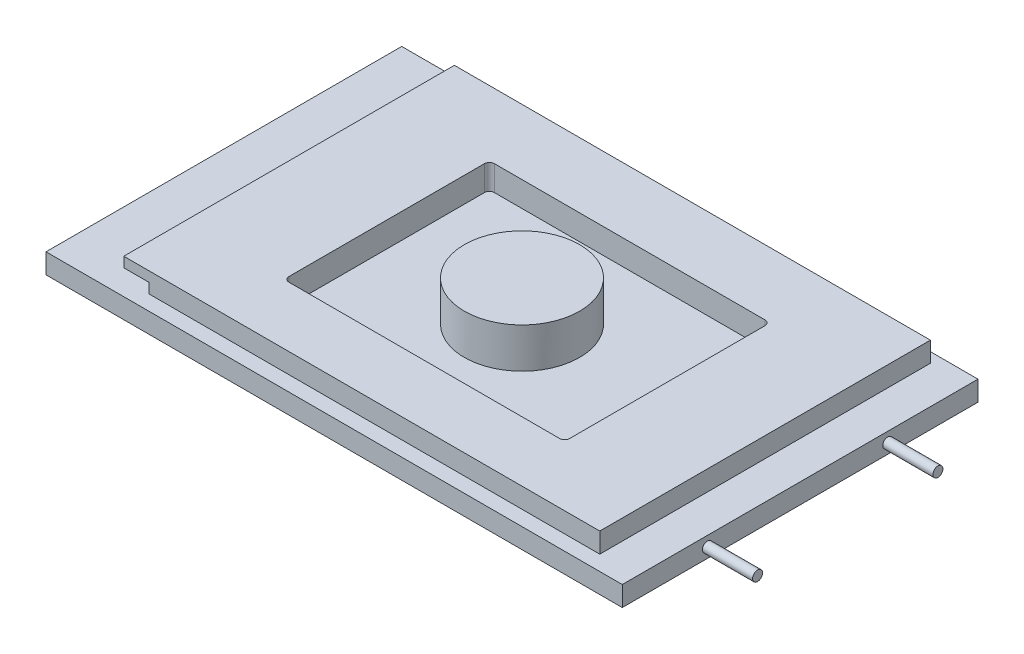
ISO-10303-21;
HEADER;
FILE_DESCRIPTION(('STEP AP214'),'2;1');
FILE_NAME('part.step','',(''),(''),'','','');
FILE_SCHEMA(('AUTOMOTIVE_DESIGN { 1 0 10303 214 1 1 1 1 }'));
ENDSEC;
DATA;
#1=APPLICATION_CONTEXT('core data for automotive mechanical design processes');
#2=APPLICATION_PROTOCOL_DEFINITION('international standard','automotive_design',2000,#1);
#3=PRODUCT_CONTEXT('',#1,'mechanical');
#4=PRODUCT('Part','Part','',(#3));
#5=PRODUCT_RELATED_PRODUCT_CATEGORY('part','',(#4));
#6=PRODUCT_DEFINITION_FORMATION('','',#4);
#7=PRODUCT_DEFINITION_CONTEXT('part definition',#1,'design');
#8=PRODUCT_DEFINITION('design','',#6,#7);
#9=PRODUCT_DEFINITION_SHAPE('','',#8);
#10=(LENGTH_UNIT() NAMED_UNIT(*) SI_UNIT(.MILLI.,.METRE.));
#11=(NAMED_UNIT(*) PLANE_ANGLE_UNIT() SI_UNIT($,.RADIAN.));
#12=(NAMED_UNIT(*) SI_UNIT($,.STERADIAN.) SOLID_ANGLE_UNIT());
#13=UNCERTAINTY_MEASURE_WITH_UNIT(LENGTH_MEASURE(1.E-05),#10,'distance_accuracy_value','');
#14=(GEOMETRIC_REPRESENTATION_CONTEXT(3) GLOBAL_UNCERTAINTY_ASSIGNED_CONTEXT((#13)) GLOBAL_UNIT_ASSIGNED_CONTEXT((#10,
#11,#12)) REPRESENTATION_CONTEXT('',''));
#15=CARTESIAN_POINT('',(0.,0.,0.));
#16=DIRECTION('',(0.,0.,1.));
#17=DIRECTION('',(1.,0.,0.));
#18=AXIS2_PLACEMENT_3D('',#15,#16,#17);
#19=CARTESIAN_POINT('',(0.,3.9878,0.));
#20=DIRECTION('',(0.,-1.,0.));
#21=DIRECTION('',(0.,0.,-1.));
#22=AXIS2_PLACEMENT_3D('',#19,#20,#21);
#23=PLANE('',#22);
#24=DIRECTION('',(0.,0.,1.));
#25=VECTOR('',#24,1.);
#26=CARTESIAN_POINT('',(0.,3.9878,0.));
#27=LINE('',#26,#25);
#28=CARTESIAN_POINT('',(0.,3.9878,-70.993));
#29=VERTEX_POINT('',#28);
#30=CARTESIAN_POINT('',(0.,3.9878,0.));
#31=VERTEX_POINT('',#30);
#32=EDGE_CURVE('E295',#29,#31,#27,.T.);
#33=ORIENTED_EDGE('',*,*,#32,.T.);
#34=DIRECTION('',(1.,0.,0.));
#35=VECTOR('',#34,1.);
#36=CARTESIAN_POINT('',(0.,3.9878,0.));
#37=LINE('',#36,#35);
#38=CARTESIAN_POINT('',(115.0112,3.9878,0.));
#39=VERTEX_POINT('',#38);
#40=EDGE_CURVE('E298',#31,#39,#37,.T.);
#41=ORIENTED_EDGE('',*,*,#40,.T.);
#42=DIRECTION('',(0.,0.,-1.));
#43=VECTOR('',#42,1.);
#44=CARTESIAN_POINT('',(115.0112,3.9878,0.));
#45=LINE('',#44,#43);
#46=CARTESIAN_POINT('',(115.0112,3.9878,-70.993));
#47=VERTEX_POINT('',#46);
#48=EDGE_CURVE('E301',#39,#47,#45,.T.);
#49=ORIENTED_EDGE('',*,*,#48,.T.);
#50=DIRECTION('',(-1.,0.,0.));
#51=VECTOR('',#50,1.);
#52=CARTESIAN_POINT('',(0.,3.9878,-70.993));
#53=LINE('',#52,#51);
#54=EDGE_CURVE('E303',#47,#29,#53,.T.);
#55=ORIENTED_EDGE('',*,*,#54,.T.);
#56=EDGE_LOOP('',(#33,#41,#49,#55));
#57=FACE_BOUND('',#56,.T.);
#58=DIRECTION('',(0.,0.,1.));
#59=VECTOR('',#58,1.);
#60=CARTESIAN_POINT('',(17.526,3.9878,-68.9864));
#61=LINE('',#60,#59);
#62=CARTESIAN_POINT('',(17.526,3.9878,-68.9864));
#63=VERTEX_POINT('',#62);
#64=CARTESIAN_POINT('',(17.526,3.9878,-2.99720000000001));
#65=VERTEX_POINT('',#64);
#66=EDGE_CURVE('E70',#63,#65,#61,.T.);
#67=ORIENTED_EDGE('',*,*,#66,.F.);
#68=DIRECTION('',(-1.,0.,0.));
#69=VECTOR('',#68,1.);
#70=CARTESIAN_POINT('',(17.526,3.9878,-68.9864));
#71=LINE('',#70,#69);
#72=CARTESIAN_POINT('',(107.5182,3.9878,-68.9864));
#73=VERTEX_POINT('',#72);
#74=EDGE_CURVE('E274',#73,#63,#71,.T.);
#75=ORIENTED_EDGE('',*,*,#74,.F.);
#76=DIRECTION('',(0.,0.,-1.));
#77=VECTOR('',#76,1.);
#78=CARTESIAN_POINT('',(107.5182,3.9878,-68.9864));
#79=LINE('',#78,#77);
#80=CARTESIAN_POINT('',(107.5182,3.9878,-2.9972));
#81=VERTEX_POINT('',#80);
#82=EDGE_CURVE('E279',#81,#73,#79,.T.);
#83=ORIENTED_EDGE('',*,*,#82,.F.);
#84=DIRECTION('',(1.,0.,0.));
#85=VECTOR('',#84,1.);
#86=CARTESIAN_POINT('',(17.526,3.9878,-2.99720000000001));
#87=LINE('',#86,#85);
#88=EDGE_CURVE('E276',#65,#81,#87,.T.);
#89=ORIENTED_EDGE('',*,*,#88,.F.);
#90=EDGE_LOOP('',(#67,#75,#83,#89));
#91=FACE_BOUND('',#90,.T.);
#92=ADVANCED_FACE('F47',(#57,#91),#23,.F.);
#93=CARTESIAN_POINT('',(0.,3.9878,0.));
#94=DIRECTION('',(1.,0.,0.));
#95=DIRECTION('',(0.,0.,-1.));
#96=AXIS2_PLACEMENT_3D('',#93,#94,#95);
#97=PLANE('',#96);
#98=DIRECTION('',(0.,0.,1.));
#99=VECTOR('',#98,1.);
#100=CARTESIAN_POINT('',(0.,0.,0.));
#101=LINE('',#100,#99);
#102=CARTESIAN_POINT('',(0.,0.,-70.993));
#103=VERTEX_POINT('',#102);
#104=CARTESIAN_POINT('',(0.,0.,0.));
#105=VERTEX_POINT('',#104);
#106=EDGE_CURVE('E294',#103,#105,#101,.T.);
#107=ORIENTED_EDGE('',*,*,#106,.T.);
#108=DIRECTION('',(0.,-1.,0.));
#109=VECTOR('',#108,1.);
#110=CARTESIAN_POINT('',(0.,3.9878,0.));
#111=LINE('',#110,#109);
#112=EDGE_CURVE('E321',#31,#105,#111,.T.);
#113=ORIENTED_EDGE('',*,*,#112,.F.);
#114=ORIENTED_EDGE('',*,*,#32,.F.);
#115=DIRECTION('',(0.,-1.,0.));
#116=VECTOR('',#115,1.);
#117=CARTESIAN_POINT('',(0.,3.9878,-70.993));
#118=LINE('',#117,#116);
#119=EDGE_CURVE('E305',#29,#103,#118,.T.);
#120=ORIENTED_EDGE('',*,*,#119,.T.);
#121=EDGE_LOOP('',(#107,#113,#114,#120));
#122=FACE_BOUND('',#121,.T.);
#123=ADVANCED_FACE('F49',(#122),#97,.F.);
#124=CARTESIAN_POINT('',(0.,3.9878,0.));
#125=DIRECTION('',(0.,0.,-1.));
#126=DIRECTION('',(-1.,0.,0.));
#127=AXIS2_PLACEMENT_3D('',#124,#125,#126);
#128=PLANE('',#127);
#129=DIRECTION('',(1.,0.,0.));
#130=VECTOR('',#129,1.);
#131=CARTESIAN_POINT('',(0.,0.,0.));
#132=LINE('',#131,#130);
#133=CARTESIAN_POINT('',(115.0112,0.,0.));
#134=VERTEX_POINT('',#133);
#135=EDGE_CURVE('E308',#105,#134,#132,.T.);
#136=ORIENTED_EDGE('',*,*,#135,.T.);
#137=DIRECTION('',(0.,-1.,0.));
#138=VECTOR('',#137,1.);
#139=CARTESIAN_POINT('',(115.0112,3.9878,0.));
#140=LINE('',#139,#138);
#141=EDGE_CURVE('E318',#39,#134,#140,.T.);
#142=ORIENTED_EDGE('',*,*,#141,.F.);
#143=ORIENTED_EDGE('',*,*,#40,.F.);
#144=ORIENTED_EDGE('',*,*,#112,.T.);
#145=EDGE_LOOP('',(#136,#142,#143,#144));
#146=FACE_BOUND('',#145,.T.);
#147=ADVANCED_FACE('F335',(#146),#128,.F.);
#148=CARTESIAN_POINT('',(115.0112,3.9878,0.));
#149=DIRECTION('',(-1.,0.,0.));
#150=DIRECTION('',(0.,0.,1.));
#151=AXIS2_PLACEMENT_3D('',#148,#149,#150);
#152=PLANE('',#151);
#153=CARTESIAN_POINT('',(115.0112,1.99898,-52.9844));
#154=DIRECTION('',(-1.,0.,0.));
#155=DIRECTION('',(0.,0.,1.));
#156=AXIS2_PLACEMENT_3D('',#153,#154,#155);
#157=CIRCLE('',#156,0.99949);
#158=CARTESIAN_POINT('',(115.0112,1.99898,-51.98491));
#159=VERTEX_POINT('',#158);
#160=EDGE_CURVE('E13',#159,#159,#157,.F.);
#161=ORIENTED_EDGE('',*,*,#160,.F.);
#162=EDGE_LOOP('',(#161));
#163=FACE_BOUND('',#162,.T.);
#164=CARTESIAN_POINT('',(115.0112,1.99898,-16.9926));
#165=DIRECTION('',(-1.,0.,0.));
#166=DIRECTION('',(0.,0.,1.));
#167=AXIS2_PLACEMENT_3D('',#164,#165,#166);
#168=CIRCLE('',#167,0.999490000000001);
#169=CARTESIAN_POINT('',(115.0112,1.99898,-15.99311));
#170=VERTEX_POINT('',#169);
#171=EDGE_CURVE('E55',#170,#170,#168,.F.);
#172=ORIENTED_EDGE('',*,*,#171,.F.);
#173=EDGE_LOOP('',(#172));
#174=FACE_BOUND('',#173,.T.);
#175=DIRECTION('',(0.,0.,-1.));
#176=VECTOR('',#175,1.);
#177=CARTESIAN_POINT('',(115.0112,0.,0.));
#178=LINE('',#177,#176);
#179=CARTESIAN_POINT('',(115.0112,0.,-70.993));
#180=VERTEX_POINT('',#179);
#181=EDGE_CURVE('E310',#134,#180,#178,.T.);
#182=ORIENTED_EDGE('',*,*,#181,.T.);
#183=DIRECTION('',(0.,-1.,0.));
#184=VECTOR('',#183,1.);
#185=CARTESIAN_POINT('',(115.0112,3.9878,-70.993));
#186=LINE('',#185,#184);
#187=EDGE_CURVE('E315',#47,#180,#186,.T.);
#188=ORIENTED_EDGE('',*,*,#187,.F.);
#189=ORIENTED_EDGE('',*,*,#48,.F.);
#190=ORIENTED_EDGE('',*,*,#141,.T.);
#191=EDGE_LOOP('',(#182,#188,#189,#190));
#192=FACE_BOUND('',#191,.T.);
#193=ADVANCED_FACE('F331',(#163,#174,#192),#152,.F.);
#194=CARTESIAN_POINT('',(0.,3.9878,-70.993));
#195=DIRECTION('',(0.,0.,1.));
#196=DIRECTION('',(1.,0.,0.));
#197=AXIS2_PLACEMENT_3D('',#194,#195,#196);
#198=PLANE('',#197);
#199=DIRECTION('',(-1.,0.,0.));
#200=VECTOR('',#199,1.);
#201=CARTESIAN_POINT('',(0.,0.,-70.993));
#202=LINE('',#201,#200);
#203=EDGE_CURVE('E299',#180,#103,#202,.T.);
#204=ORIENTED_EDGE('',*,*,#203,.T.);
#205=ORIENTED_EDGE('',*,*,#119,.F.);
#206=ORIENTED_EDGE('',*,*,#54,.F.);
#207=ORIENTED_EDGE('',*,*,#187,.T.);
#208=EDGE_LOOP('',(#204,#205,#206,#207));
#209=FACE_BOUND('',#208,.T.);
#210=ADVANCED_FACE('F334',(#209),#198,.F.);
#211=CARTESIAN_POINT('',(0.,0.,0.));
#212=DIRECTION('',(0.,-1.,0.));
#213=DIRECTION('',(0.,0.,-1.));
#214=AXIS2_PLACEMENT_3D('',#211,#212,#213);
#215=PLANE('',#214);
#216=ORIENTED_EDGE('',*,*,#106,.F.);
#217=ORIENTED_EDGE('',*,*,#203,.F.);
#218=ORIENTED_EDGE('',*,*,#181,.F.);
#219=ORIENTED_EDGE('',*,*,#135,.F.);
#220=EDGE_LOOP('',(#216,#217,#218,#219));
#221=FACE_BOUND('',#220,.T.);
#222=ADVANCED_FACE('F348',(#221),#215,.T.);
#223=CARTESIAN_POINT('',(17.526,5.98678,-68.9864));
#224=DIRECTION('',(1.,0.,0.));
#225=DIRECTION('',(0.,0.,-1.));
#226=AXIS2_PLACEMENT_3D('',#223,#224,#225);
#227=PLANE('',#226);
#228=ORIENTED_EDGE('',*,*,#66,.T.);
#229=DIRECTION('',(0.,-1.,0.));
#230=VECTOR('',#229,1.);
#231=CARTESIAN_POINT('',(17.526,5.98678,-2.99720000000001));
#232=LINE('',#231,#230);
#233=CARTESIAN_POINT('',(17.526,5.98678,-2.99720000000001));
#234=VERTEX_POINT('',#233);
#235=EDGE_CURVE('E291',#234,#65,#232,.T.);
#236=ORIENTED_EDGE('',*,*,#235,.F.);
#237=DIRECTION('',(0.,0.,1.));
#238=VECTOR('',#237,1.);
#239=CARTESIAN_POINT('',(17.526,5.98678,-68.9864));
#240=LINE('',#239,#238);
#241=CARTESIAN_POINT('',(17.526,5.98678,-68.9864));
#242=VERTEX_POINT('',#241);
#243=EDGE_CURVE('E270',#242,#234,#240,.T.);
#244=ORIENTED_EDGE('',*,*,#243,.F.);
#245=DIRECTION('',(0.,-1.,0.));
#246=VECTOR('',#245,1.);
#247=CARTESIAN_POINT('',(17.526,5.98678,-68.9864));
#248=LINE('',#247,#246);
#249=EDGE_CURVE('E273',#242,#63,#248,.T.);
#250=ORIENTED_EDGE('',*,*,#249,.T.);
#251=EDGE_LOOP('',(#228,#236,#244,#250));
#252=FACE_BOUND('',#251,.T.);
#253=ADVANCED_FACE('F364',(#252),#227,.F.);
#254=CARTESIAN_POINT('',(17.526,5.98678,-2.99720000000001));
#255=DIRECTION('',(0.,0.,-1.));
#256=DIRECTION('',(-1.,0.,0.));
#257=AXIS2_PLACEMENT_3D('',#254,#255,#256);
#258=PLANE('',#257);
#259=ORIENTED_EDGE('',*,*,#88,.T.);
#260=DIRECTION('',(0.,-1.,0.));
#261=VECTOR('',#260,1.);
#262=CARTESIAN_POINT('',(107.5182,5.98678,-2.9972));
#263=LINE('',#262,#261);
#264=CARTESIAN_POINT('',(107.5182,7.98576,-2.99720000000001));
#265=VERTEX_POINT('',#264);
#266=EDGE_CURVE('E288',#265,#81,#263,.T.);
#267=ORIENTED_EDGE('',*,*,#266,.F.);
#268=DIRECTION('',(-1.,0.,0.));
#269=VECTOR('',#268,1.);
#270=CARTESIAN_POINT('',(12.5222,7.98576,-2.99720000000001));
#271=LINE('',#270,#269);
#272=CARTESIAN_POINT('',(12.5222,7.98576,-2.99720000000001));
#273=VERTEX_POINT('',#272);
#274=EDGE_CURVE('E234',#265,#273,#271,.T.);
#275=ORIENTED_EDGE('',*,*,#274,.T.);
#276=DIRECTION('',(0.,-1.,0.));
#277=VECTOR('',#276,1.);
#278=CARTESIAN_POINT('',(12.5222,5.98678,-2.99720000000001));
#279=LINE('',#278,#277);
#280=CARTESIAN_POINT('',(12.5222,5.98678,-2.99720000000001));
#281=VERTEX_POINT('',#280);
#282=EDGE_CURVE('E259',#273,#281,#279,.T.);
#283=ORIENTED_EDGE('',*,*,#282,.T.);
#284=DIRECTION('',(1.,0.,0.));
#285=VECTOR('',#284,1.);
#286=CARTESIAN_POINT('',(17.526,5.98678,-2.99720000000001));
#287=LINE('',#286,#285);
#288=EDGE_CURVE('E250',#281,#234,#287,.T.);
#289=ORIENTED_EDGE('',*,*,#288,.T.);
#290=ORIENTED_EDGE('',*,*,#235,.T.);
#291=EDGE_LOOP('',(#259,#267,#275,#283,#289,#290));
#292=FACE_BOUND('',#291,.T.);
#293=ADVANCED_FACE('F383',(#292),#258,.F.);
#294=CARTESIAN_POINT('',(107.5182,5.98678,-68.9864));
#295=DIRECTION('',(-1.,0.,0.));
#296=DIRECTION('',(0.,0.,1.));
#297=AXIS2_PLACEMENT_3D('',#294,#295,#296);
#298=PLANE('',#297);
#299=ORIENTED_EDGE('',*,*,#82,.T.);
#300=DIRECTION('',(0.,-1.,0.));
#301=VECTOR('',#300,1.);
#302=CARTESIAN_POINT('',(107.5182,5.98678,-68.9864));
#303=LINE('',#302,#301);
#304=CARTESIAN_POINT('',(107.5182,7.98576,-68.9864));
#305=VERTEX_POINT('',#304);
#306=EDGE_CURVE('E285',#305,#73,#303,.T.);
#307=ORIENTED_EDGE('',*,*,#306,.F.);
#308=DIRECTION('',(0.,0.,1.));
#309=VECTOR('',#308,1.);
#310=CARTESIAN_POINT('',(107.5182,7.98576,-68.9864));
#311=LINE('',#310,#309);
#312=EDGE_CURVE('E256',#305,#265,#311,.T.);
#313=ORIENTED_EDGE('',*,*,#312,.T.);
#314=ORIENTED_EDGE('',*,*,#266,.T.);
#315=EDGE_LOOP('',(#299,#307,#313,#314));
#316=FACE_BOUND('',#315,.T.);
#317=ADVANCED_FACE('F390',(#316),#298,.F.);
#318=CARTESIAN_POINT('',(17.526,5.98678,-68.9864));
#319=DIRECTION('',(0.,0.,1.));
#320=DIRECTION('',(1.,0.,0.));
#321=AXIS2_PLACEMENT_3D('',#318,#319,#320);
#322=PLANE('',#321);
#323=ORIENTED_EDGE('',*,*,#74,.T.);
#324=ORIENTED_EDGE('',*,*,#249,.F.);
#325=DIRECTION('',(1.,0.,0.));
#326=VECTOR('',#325,1.);
#327=CARTESIAN_POINT('',(17.526,5.98678,-68.9864));
#328=LINE('',#327,#326);
#329=CARTESIAN_POINT('',(12.5222,5.98678,-68.9864));
#330=VERTEX_POINT('',#329);
#331=EDGE_CURVE('E246',#330,#242,#328,.T.);
#332=ORIENTED_EDGE('',*,*,#331,.F.);
#333=DIRECTION('',(0.,-1.,0.));
#334=VECTOR('',#333,1.);
#335=CARTESIAN_POINT('',(12.5222,5.98678,-68.9864));
#336=LINE('',#335,#334);
#337=CARTESIAN_POINT('',(12.5222,7.98576,-68.9864));
#338=VERTEX_POINT('',#337);
#339=EDGE_CURVE('E253',#338,#330,#336,.T.);
#340=ORIENTED_EDGE('',*,*,#339,.F.);
#341=DIRECTION('',(-1.,0.,0.));
#342=VECTOR('',#341,1.);
#343=CARTESIAN_POINT('',(12.5222,7.98576,-68.9864));
#344=LINE('',#343,#342);
#345=EDGE_CURVE('E249',#305,#338,#344,.T.);
#346=ORIENTED_EDGE('',*,*,#345,.F.);
#347=ORIENTED_EDGE('',*,*,#306,.T.);
#348=EDGE_LOOP('',(#323,#324,#332,#340,#346,#347));
#349=FACE_BOUND('',#348,.T.);
#350=ADVANCED_FACE('F397',(#349),#322,.F.);
#351=CARTESIAN_POINT('',(17.526,5.98678,-68.9864));
#352=DIRECTION('',(0.,-1.,0.));
#353=DIRECTION('',(1.,0.,0.));
#354=AXIS2_PLACEMENT_3D('',#351,#352,#353);
#355=PLANE('',#354);
#356=ORIENTED_EDGE('',*,*,#331,.T.);
#357=ORIENTED_EDGE('',*,*,#243,.T.);
#358=ORIENTED_EDGE('',*,*,#288,.F.);
#359=DIRECTION('',(0.,0.,1.));
#360=VECTOR('',#359,1.);
#361=CARTESIAN_POINT('',(12.5222,5.98678,-68.9864));
#362=LINE('',#361,#360);
#363=EDGE_CURVE('E264',#330,#281,#362,.T.);
#364=ORIENTED_EDGE('',*,*,#363,.F.);
#365=EDGE_LOOP('',(#356,#357,#358,#364));
#366=FACE_BOUND('',#365,.T.);
#367=ADVANCED_FACE('F405',(#366),#355,.T.);
#368=CARTESIAN_POINT('',(12.5222,5.98678,-68.9864));
#369=DIRECTION('',(-1.,0.,0.));
#370=DIRECTION('',(0.,0.,1.));
#371=AXIS2_PLACEMENT_3D('',#368,#369,#370);
#372=PLANE('',#371);
#373=ORIENTED_EDGE('',*,*,#282,.F.);
#374=DIRECTION('',(0.,0.,1.));
#375=VECTOR('',#374,1.);
#376=CARTESIAN_POINT('',(12.5222,7.98576,-68.9864));
#377=LINE('',#376,#375);
#378=EDGE_CURVE('E266',#338,#273,#377,.T.);
#379=ORIENTED_EDGE('',*,*,#378,.F.);
#380=ORIENTED_EDGE('',*,*,#339,.T.);
#381=ORIENTED_EDGE('',*,*,#363,.T.);
#382=EDGE_LOOP('',(#373,#379,#380,#381));
#383=FACE_BOUND('',#382,.T.);
#384=ADVANCED_FACE('F413',(#383),#372,.T.);
#385=CARTESIAN_POINT('',(12.5222,7.98576,-68.9864));
#386=DIRECTION('',(0.,1.,0.));
#387=DIRECTION('',(0.,0.,1.));
#388=AXIS2_PLACEMENT_3D('',#385,#386,#387);
#389=PLANE('',#388);
#390=CARTESIAN_POINT('',(87.5284,7.98576,-54.991));
#391=DIRECTION('',(0.,1.,0.));
#392=DIRECTION('',(0.,0.,-1.));
#393=AXIS2_PLACEMENT_3D('',#390,#391,#392);
#394=CIRCLE('',#393,0.990599999999998);
#395=CARTESIAN_POINT('',(88.519,7.98576,-54.991));
#396=VERTEX_POINT('',#395);
#397=CARTESIAN_POINT('',(87.5284,7.98576,-55.9816));
#398=VERTEX_POINT('',#397);
#399=EDGE_CURVE('E62',#396,#398,#394,.T.);
#400=ORIENTED_EDGE('',*,*,#399,.F.);
#401=DIRECTION('',(0.,0.,-1.));
#402=VECTOR('',#401,1.);
#403=CARTESIAN_POINT('',(88.519,7.98576,-15.9766));
#404=LINE('',#403,#402);
#405=CARTESIAN_POINT('',(88.519,7.98576,-15.9766));
#406=VERTEX_POINT('',#405);
#407=EDGE_CURVE('E193',#406,#396,#404,.T.);
#408=ORIENTED_EDGE('',*,*,#407,.F.);
#409=CARTESIAN_POINT('',(87.5284,7.98576,-15.9766));
#410=DIRECTION('',(0.,1.,0.));
#411=DIRECTION('',(0.,0.,-1.));
#412=AXIS2_PLACEMENT_3D('',#409,#410,#411);
#413=CIRCLE('',#412,0.990599999999998);
#414=CARTESIAN_POINT('',(87.5284,7.98576,-14.986));
#415=VERTEX_POINT('',#414);
#416=EDGE_CURVE('E196',#415,#406,#413,.T.);
#417=ORIENTED_EDGE('',*,*,#416,.F.);
#418=DIRECTION('',(1.,0.,0.));
#419=VECTOR('',#418,1.);
#420=CARTESIAN_POINT('',(33.5026,7.98576,-14.986));
#421=LINE('',#420,#419);
#422=CARTESIAN_POINT('',(33.5026,7.98576,-14.986));
#423=VERTEX_POINT('',#422);
#424=EDGE_CURVE('E227',#423,#415,#421,.T.);
#425=ORIENTED_EDGE('',*,*,#424,.F.);
#426=CARTESIAN_POINT('',(33.5026,7.98576,-15.9766));
#427=DIRECTION('',(0.,1.,0.));
#428=DIRECTION('',(0.,0.,-1.));
#429=AXIS2_PLACEMENT_3D('',#426,#427,#428);
#430=CIRCLE('',#429,0.990600000000001);
#431=CARTESIAN_POINT('',(32.512,7.98576,-15.9766));
#432=VERTEX_POINT('',#431);
#433=EDGE_CURVE('E224',#432,#423,#430,.T.);
#434=ORIENTED_EDGE('',*,*,#433,.F.);
#435=DIRECTION('',(0.,0.,1.));
#436=VECTOR('',#435,1.);
#437=CARTESIAN_POINT('',(32.512,7.98576,-15.9766));
#438=LINE('',#437,#436);
#439=CARTESIAN_POINT('',(32.512,7.98576,-54.991));
#440=VERTEX_POINT('',#439);
#441=EDGE_CURVE('E221',#440,#432,#438,.T.);
#442=ORIENTED_EDGE('',*,*,#441,.F.);
#443=CARTESIAN_POINT('',(33.5026,7.98576,-54.991));
#444=DIRECTION('',(0.,1.,0.));
#445=DIRECTION('',(0.,0.,-1.));
#446=AXIS2_PLACEMENT_3D('',#443,#444,#445);
#447=CIRCLE('',#446,0.990600000000001);
#448=CARTESIAN_POINT('',(33.5026,7.98576,-55.9816));
#449=VERTEX_POINT('',#448);
#450=EDGE_CURVE('E218',#449,#440,#447,.T.);
#451=ORIENTED_EDGE('',*,*,#450,.F.);
#452=DIRECTION('',(-1.,0.,0.));
#453=VECTOR('',#452,1.);
#454=CARTESIAN_POINT('',(33.5026,7.98576,-55.9816));
#455=LINE('',#454,#453);
#456=EDGE_CURVE('E216',#398,#449,#455,.T.);
#457=ORIENTED_EDGE('',*,*,#456,.F.);
#458=EDGE_LOOP('',(#400,#408,#417,#425,#434,#442,#451,#457));
#459=FACE_BOUND('',#458,.T.);
#460=ORIENTED_EDGE('',*,*,#274,.F.);
#461=ORIENTED_EDGE('',*,*,#312,.F.);
#462=ORIENTED_EDGE('',*,*,#345,.T.);
#463=ORIENTED_EDGE('',*,*,#378,.T.);
#464=EDGE_LOOP('',(#460,#461,#462,#463));
#465=FACE_BOUND('',#464,.T.);
#466=ADVANCED_FACE('F421',(#459,#465),#389,.T.);
#467=CARTESIAN_POINT('',(87.5284,2.98196,-54.991));
#468=DIRECTION('',(0.,1.,0.));
#469=DIRECTION('',(0.,0.,1.));
#470=AXIS2_PLACEMENT_3D('',#467,#468,#469);
#471=CYLINDRICAL_SURFACE('',#470,0.990599999999998);
#472=ORIENTED_EDGE('',*,*,#399,.T.);
#473=DIRECTION('',(0.,1.,0.));
#474=VECTOR('',#473,1.);
#475=CARTESIAN_POINT('',(87.5284,2.98196,-55.9816));
#476=LINE('',#475,#474);
#477=CARTESIAN_POINT('',(87.5284,2.98196,-55.9816));
#478=VERTEX_POINT('',#477);
#479=EDGE_CURVE('E170',#478,#398,#476,.T.);
#480=ORIENTED_EDGE('',*,*,#479,.F.);
#481=CARTESIAN_POINT('',(87.5284,2.98196,-54.991));
#482=DIRECTION('',(0.,1.,0.));
#483=DIRECTION('',(0.,0.,-1.));
#484=AXIS2_PLACEMENT_3D('',#481,#482,#483);
#485=CIRCLE('',#484,0.990599999999998);
#486=CARTESIAN_POINT('',(88.519,2.98196,-54.991));
#487=VERTEX_POINT('',#486);
#488=EDGE_CURVE('E174',#487,#478,#485,.T.);
#489=ORIENTED_EDGE('',*,*,#488,.F.);
#490=DIRECTION('',(0.,1.,0.));
#491=VECTOR('',#490,1.);
#492=CARTESIAN_POINT('',(88.519,2.98196,-54.991));
#493=LINE('',#492,#491);
#494=EDGE_CURVE('E232',#487,#396,#493,.T.);
#495=ORIENTED_EDGE('',*,*,#494,.T.);
#496=EDGE_LOOP('',(#472,#480,#489,#495));
#497=FACE_BOUND('',#496,.T.);
#498=ADVANCED_FACE('F172',(#497),#471,.F.);
#499=CARTESIAN_POINT('',(88.519,2.98196,-15.9766));
#500=DIRECTION('',(1.,0.,0.));
#501=DIRECTION('',(0.,0.,-1.));
#502=AXIS2_PLACEMENT_3D('',#499,#500,#501);
#503=PLANE('',#502);
#504=ORIENTED_EDGE('',*,*,#407,.T.);
#505=ORIENTED_EDGE('',*,*,#494,.F.);
#506=DIRECTION('',(0.,0.,-1.));
#507=VECTOR('',#506,1.);
#508=CARTESIAN_POINT('',(88.519,2.98196,-15.9766));
#509=LINE('',#508,#507);
#510=CARTESIAN_POINT('',(88.519,2.98196,-15.9766));
#511=VERTEX_POINT('',#510);
#512=EDGE_CURVE('E180',#511,#487,#509,.T.);
#513=ORIENTED_EDGE('',*,*,#512,.F.);
#514=DIRECTION('',(0.,1.,0.));
#515=VECTOR('',#514,1.);
#516=CARTESIAN_POINT('',(88.519,2.98196,-15.9766));
#517=LINE('',#516,#515);
#518=EDGE_CURVE('E235',#511,#406,#517,.T.);
#519=ORIENTED_EDGE('',*,*,#518,.T.);
#520=EDGE_LOOP('',(#504,#505,#513,#519));
#521=FACE_BOUND('',#520,.T.);
#522=ADVANCED_FACE('F436',(#521),#503,.F.);
#523=CARTESIAN_POINT('',(87.5284,2.98196,-15.9766));
#524=DIRECTION('',(0.,1.,0.));
#525=DIRECTION('',(0.,0.,1.));
#526=AXIS2_PLACEMENT_3D('',#523,#524,#525);
#527=CYLINDRICAL_SURFACE('',#526,0.990599999999998);
#528=ORIENTED_EDGE('',*,*,#416,.T.);
#529=ORIENTED_EDGE('',*,*,#518,.F.);
#530=CARTESIAN_POINT('',(87.5284,2.98196,-15.9766));
#531=DIRECTION('',(0.,1.,0.));
#532=DIRECTION('',(0.,0.,-1.));
#533=AXIS2_PLACEMENT_3D('',#530,#531,#532);
#534=CIRCLE('',#533,0.990599999999998);
#535=CARTESIAN_POINT('',(87.5284,2.98196,-14.986));
#536=VERTEX_POINT('',#535);
#537=EDGE_CURVE('E212',#536,#511,#534,.T.);
#538=ORIENTED_EDGE('',*,*,#537,.F.);
#539=DIRECTION('',(0.,1.,0.));
#540=VECTOR('',#539,1.);
#541=CARTESIAN_POINT('',(87.5284,2.98196,-14.986));
#542=LINE('',#541,#540);
#543=EDGE_CURVE('E237',#536,#415,#542,.T.);
#544=ORIENTED_EDGE('',*,*,#543,.T.);
#545=EDGE_LOOP('',(#528,#529,#538,#544));
#546=FACE_BOUND('',#545,.T.);
#547=ADVANCED_FACE('F443',(#546),#527,.F.);
#548=CARTESIAN_POINT('',(33.5026,2.98196,-14.986));
#549=DIRECTION('',(0.,0.,1.));
#550=DIRECTION('',(1.,0.,0.));
#551=AXIS2_PLACEMENT_3D('',#548,#549,#550);
#552=PLANE('',#551);
#553=ORIENTED_EDGE('',*,*,#424,.T.);
#554=ORIENTED_EDGE('',*,*,#543,.F.);
#555=DIRECTION('',(1.,0.,0.));
#556=VECTOR('',#555,1.);
#557=CARTESIAN_POINT('',(33.5026,2.98196,-14.986));
#558=LINE('',#557,#556);
#559=CARTESIAN_POINT('',(33.5026,2.98196,-14.986));
#560=VERTEX_POINT('',#559);
#561=EDGE_CURVE('E209',#560,#536,#558,.T.);
#562=ORIENTED_EDGE('',*,*,#561,.F.);
#563=DIRECTION('',(0.,1.,0.));
#564=VECTOR('',#563,1.);
#565=CARTESIAN_POINT('',(33.5026,2.98196,-14.986));
#566=LINE('',#565,#564);
#567=EDGE_CURVE('E239',#560,#423,#566,.T.);
#568=ORIENTED_EDGE('',*,*,#567,.T.);
#569=EDGE_LOOP('',(#553,#554,#562,#568));
#570=FACE_BOUND('',#569,.T.);
#571=ADVANCED_FACE('F451',(#570),#552,.F.);
#572=CARTESIAN_POINT('',(33.5026,2.98196,-15.9766));
#573=DIRECTION('',(0.,1.,0.));
#574=DIRECTION('',(0.,0.,1.));
#575=AXIS2_PLACEMENT_3D('',#572,#573,#574);
#576=CYLINDRICAL_SURFACE('',#575,0.990600000000001);
#577=ORIENTED_EDGE('',*,*,#433,.T.);
#578=ORIENTED_EDGE('',*,*,#567,.F.);
#579=CARTESIAN_POINT('',(33.5026,2.98196,-15.9766));
#580=DIRECTION('',(0.,1.,0.));
#581=DIRECTION('',(0.,0.,-1.));
#582=AXIS2_PLACEMENT_3D('',#579,#580,#581);
#583=CIRCLE('',#582,0.990600000000001);
#584=CARTESIAN_POINT('',(32.512,2.98196,-15.9766));
#585=VERTEX_POINT('',#584);
#586=EDGE_CURVE('E206',#585,#560,#583,.T.);
#587=ORIENTED_EDGE('',*,*,#586,.F.);
#588=DIRECTION('',(0.,1.,0.));
#589=VECTOR('',#588,1.);
#590=CARTESIAN_POINT('',(32.512,2.98196,-15.9766));
#591=LINE('',#590,#589);
#592=EDGE_CURVE('E241',#585,#432,#591,.T.);
#593=ORIENTED_EDGE('',*,*,#592,.T.);
#594=EDGE_LOOP('',(#577,#578,#587,#593));
#595=FACE_BOUND('',#594,.T.);
#596=ADVANCED_FACE('F459',(#595),#576,.F.);
#597=CARTESIAN_POINT('',(32.512,2.98196,-15.9766));
#598=DIRECTION('',(-1.,0.,0.));
#599=DIRECTION('',(0.,0.,1.));
#600=AXIS2_PLACEMENT_3D('',#597,#598,#599);
#601=PLANE('',#600);
#602=ORIENTED_EDGE('',*,*,#441,.T.);
#603=ORIENTED_EDGE('',*,*,#592,.F.);
#604=DIRECTION('',(0.,0.,1.));
#605=VECTOR('',#604,1.);
#606=CARTESIAN_POINT('',(32.512,2.98196,-15.9766));
#607=LINE('',#606,#605);
#608=CARTESIAN_POINT('',(32.512,2.98196,-54.991));
#609=VERTEX_POINT('',#608);
#610=EDGE_CURVE('E203',#609,#585,#607,.T.);
#611=ORIENTED_EDGE('',*,*,#610,.F.);
#612=DIRECTION('',(0.,1.,0.));
#613=VECTOR('',#612,1.);
#614=CARTESIAN_POINT('',(32.512,2.98196,-54.991));
#615=LINE('',#614,#613);
#616=EDGE_CURVE('E243',#609,#440,#615,.T.);
#617=ORIENTED_EDGE('',*,*,#616,.T.);
#618=EDGE_LOOP('',(#602,#603,#611,#617));
#619=FACE_BOUND('',#618,.T.);
#620=ADVANCED_FACE('F467',(#619),#601,.F.);
#621=CARTESIAN_POINT('',(33.5026,2.98196,-54.991));
#622=DIRECTION('',(0.,1.,0.));
#623=DIRECTION('',(0.,0.,1.));
#624=AXIS2_PLACEMENT_3D('',#621,#622,#623);
#625=CYLINDRICAL_SURFACE('',#624,0.990600000000001);
#626=ORIENTED_EDGE('',*,*,#450,.T.);
#627=ORIENTED_EDGE('',*,*,#616,.F.);
#628=CARTESIAN_POINT('',(33.5026,2.98196,-54.991));
#629=DIRECTION('',(0.,1.,0.));
#630=DIRECTION('',(0.,0.,-1.));
#631=AXIS2_PLACEMENT_3D('',#628,#629,#630);
#632=CIRCLE('',#631,0.990600000000001);
#633=CARTESIAN_POINT('',(33.5026,2.98196,-55.9816));
#634=VERTEX_POINT('',#633);
#635=EDGE_CURVE('E188',#634,#609,#632,.T.);
#636=ORIENTED_EDGE('',*,*,#635,.F.);
#637=DIRECTION('',(0.,1.,0.));
#638=VECTOR('',#637,1.);
#639=CARTESIAN_POINT('',(33.5026,2.98196,-55.9816));
#640=LINE('',#639,#638);
#641=EDGE_CURVE('E179',#634,#449,#640,.T.);
#642=ORIENTED_EDGE('',*,*,#641,.T.);
#643=EDGE_LOOP('',(#626,#627,#636,#642));
#644=FACE_BOUND('',#643,.T.);
#645=ADVANCED_FACE('F475',(#644),#625,.F.);
#646=CARTESIAN_POINT('',(33.5026,2.98196,-55.9816));
#647=DIRECTION('',(0.,0.,-1.));
#648=DIRECTION('',(-1.,0.,0.));
#649=AXIS2_PLACEMENT_3D('',#646,#647,#648);
#650=PLANE('',#649);
#651=ORIENTED_EDGE('',*,*,#456,.T.);
#652=ORIENTED_EDGE('',*,*,#641,.F.);
#653=DIRECTION('',(-1.,0.,0.));
#654=VECTOR('',#653,1.);
#655=CARTESIAN_POINT('',(33.5026,2.98196,-55.9816));
#656=LINE('',#655,#654);
#657=EDGE_CURVE('E183',#478,#634,#656,.T.);
#658=ORIENTED_EDGE('',*,*,#657,.F.);
#659=ORIENTED_EDGE('',*,*,#479,.T.);
#660=EDGE_LOOP('',(#651,#652,#658,#659));
#661=FACE_BOUND('',#660,.T.);
#662=ADVANCED_FACE('F184',(#661),#650,.F.);
#663=CARTESIAN_POINT('',(87.5284,2.98196,-54.991));
#664=DIRECTION('',(0.,-1.,0.));
#665=DIRECTION('',(0.,0.,-1.));
#666=AXIS2_PLACEMENT_3D('',#663,#664,#665);
#667=PLANE('',#666);
#668=CARTESIAN_POINT('',(59.0042,2.98196,-35.9918));
#669=DIRECTION('',(0.,-1.,0.));
#670=DIRECTION('',(0.,0.,-1.));
#671=AXIS2_PLACEMENT_3D('',#668,#669,#670);
#672=CIRCLE('',#671,11.5062);
#673=CARTESIAN_POINT('',(59.0042,2.98196,-47.498));
#674=VERTEX_POINT('',#673);
#675=EDGE_CURVE('E324',#674,#674,#672,.F.);
#676=ORIENTED_EDGE('',*,*,#675,.F.);
#677=EDGE_LOOP('',(#676));
#678=FACE_BOUND('',#677,.T.);
#679=ORIENTED_EDGE('',*,*,#488,.T.);
#680=ORIENTED_EDGE('',*,*,#657,.T.);
#681=ORIENTED_EDGE('',*,*,#635,.T.);
#682=ORIENTED_EDGE('',*,*,#610,.T.);
#683=ORIENTED_EDGE('',*,*,#586,.T.);
#684=ORIENTED_EDGE('',*,*,#561,.T.);
#685=ORIENTED_EDGE('',*,*,#537,.T.);
#686=ORIENTED_EDGE('',*,*,#512,.T.);
#687=EDGE_LOOP('',(#679,#680,#681,#682,#683,#684,#685,#686));
#688=FACE_BOUND('',#687,.T.);
#689=ADVANCED_FACE('F190',(#678,#688),#667,.F.);
#690=CARTESIAN_POINT('',(59.0042,10.98296,-35.9918));
#691=DIRECTION('',(0.,-1.,0.));
#692=DIRECTION('',(0.,0.,-1.));
#693=AXIS2_PLACEMENT_3D('',#690,#691,#692);
#694=CYLINDRICAL_SURFACE('',#693,11.5062);
#695=CARTESIAN_POINT('',(59.0042,10.98296,-35.9918));
#696=DIRECTION('',(0.,1.,0.));
#697=DIRECTION('',(0.,0.,1.));
#698=AXIS2_PLACEMENT_3D('',#695,#696,#697);
#699=CIRCLE('',#698,11.5062);
#700=CARTESIAN_POINT('',(59.0042,10.98296,-24.4856));
#701=VERTEX_POINT('',#700);
#702=EDGE_CURVE('E199',#701,#701,#699,.T.);
#703=ORIENTED_EDGE('',*,*,#702,.F.);
#704=EDGE_LOOP('',(#703));
#705=FACE_BOUND('',#704,.T.);
#706=ORIENTED_EDGE('',*,*,#675,.T.);
#707=EDGE_LOOP('',(#706));
#708=FACE_BOUND('',#707,.T.);
#709=ADVANCED_FACE('F496',(#705,#708),#694,.T.);
#710=CARTESIAN_POINT('',(59.0042,10.98296,-35.9918));
#711=DIRECTION('',(0.,1.,0.));
#712=DIRECTION('',(0.,0.,1.));
#713=AXIS2_PLACEMENT_3D('',#710,#711,#712);
#714=PLANE('',#713);
#715=ORIENTED_EDGE('',*,*,#702,.T.);
#716=EDGE_LOOP('',(#715));
#717=FACE_BOUND('',#716,.T.);
#718=ADVANCED_FACE('F504',(#717),#714,.T.);
#719=CARTESIAN_POINT('',(125.0188,1.99898,-16.9926));
#720=DIRECTION('',(-1.,0.,0.));
#721=DIRECTION('',(0.,0.,1.));
#722=AXIS2_PLACEMENT_3D('',#719,#720,#721);
#723=CYLINDRICAL_SURFACE('',#722,0.999490000000001);
#724=CARTESIAN_POINT('',(125.0188,1.99898,-16.9926));
#725=DIRECTION('',(1.,0.,0.));
#726=DIRECTION('',(0.,0.,-1.));
#727=AXIS2_PLACEMENT_3D('',#724,#725,#726);
#728=CIRCLE('',#727,0.999490000000001);
#729=CARTESIAN_POINT('',(125.0188,1.99898,-17.99209));
#730=VERTEX_POINT('',#729);
#731=EDGE_CURVE('E627',#730,#730,#728,.T.);
#732=ORIENTED_EDGE('',*,*,#731,.F.);
#733=EDGE_LOOP('',(#732));
#734=FACE_BOUND('',#733,.T.);
#735=ORIENTED_EDGE('',*,*,#171,.T.);
#736=EDGE_LOOP('',(#735));
#737=FACE_BOUND('',#736,.T.);
#738=ADVANCED_FACE('F329',(#734,#737),#723,.T.);
#739=CARTESIAN_POINT('',(125.0188,1.99898,-16.9926));
#740=DIRECTION('',(1.,0.,0.));
#741=DIRECTION('',(0.,0.,-1.));
#742=AXIS2_PLACEMENT_3D('',#739,#740,#741);
#743=PLANE('',#742);
#744=ORIENTED_EDGE('',*,*,#731,.T.);
#745=EDGE_LOOP('',(#744));
#746=FACE_BOUND('',#745,.T.);
#747=ADVANCED_FACE('F519',(#746),#743,.T.);
#748=CARTESIAN_POINT('',(125.0188,1.99898,-52.9844));
#749=DIRECTION('',(-1.,0.,0.));
#750=DIRECTION('',(0.,0.,1.));
#751=AXIS2_PLACEMENT_3D('',#748,#749,#750);
#752=CYLINDRICAL_SURFACE('',#751,0.99949);
#753=CARTESIAN_POINT('',(125.0188,1.99898,-52.9844));
#754=DIRECTION('',(1.,0.,0.));
#755=DIRECTION('',(0.,0.,-1.));
#756=AXIS2_PLACEMENT_3D('',#753,#754,#755);
#757=CIRCLE('',#756,0.99949);
#758=CARTESIAN_POINT('',(125.0188,1.99898,-53.98389));
#759=VERTEX_POINT('',#758);
#760=EDGE_CURVE('E626',#759,#759,#757,.T.);
#761=ORIENTED_EDGE('',*,*,#760,.F.);
#762=EDGE_LOOP('',(#761));
#763=FACE_BOUND('',#762,.T.);
#764=ORIENTED_EDGE('',*,*,#160,.T.);
#765=EDGE_LOOP('',(#764));
#766=FACE_BOUND('',#765,.T.);
#767=ADVANCED_FACE('F527',(#763,#766),#752,.T.);
#768=CARTESIAN_POINT('',(125.0188,1.99898,-52.9844));
#769=DIRECTION('',(1.,0.,0.));
#770=DIRECTION('',(0.,0.,-1.));
#771=AXIS2_PLACEMENT_3D('',#768,#769,#770);
#772=PLANE('',#771);
#773=ORIENTED_EDGE('',*,*,#760,.T.);
#774=EDGE_LOOP('',(#773));
#775=FACE_BOUND('',#774,.T.);
#776=ADVANCED_FACE('F535',(#775),#772,.T.);
#777=CLOSED_SHELL('',(#92,#123,#147,#193,#210,#222,#253,#293,#317,#350,#367,#384,#466,#498,#522,
#547,#571,#596,#620,#645,#662,#689,#709,#718,#738,#747,#767,#776));
#778=MANIFOLD_SOLID_BREP('B2',#777);
#779=ADVANCED_BREP_SHAPE_REPRESENTATION('',(#18,#778),#14);
#780=SHAPE_DEFINITION_REPRESENTATION(#9,#779);
ENDSEC;
END-ISO-10303-21;
